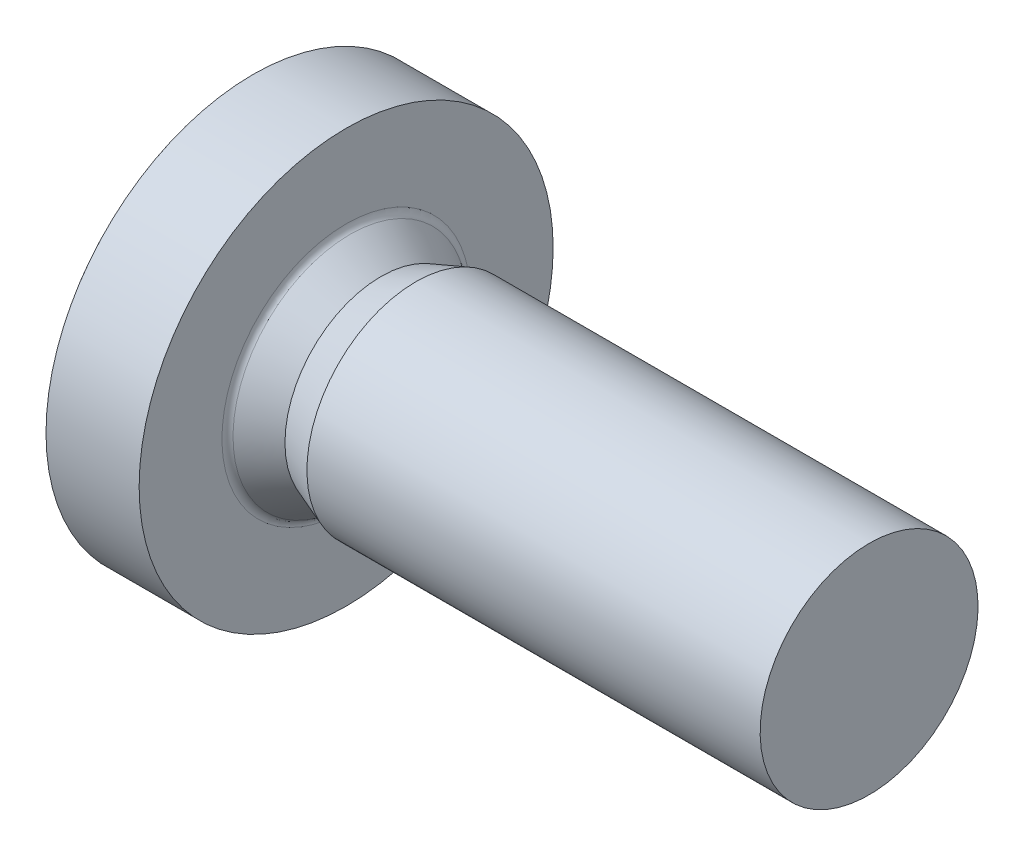
ISO-10303-21;
HEADER;
FILE_DESCRIPTION(('STEP AP214'),'2;1');
FILE_NAME('part.step','',(''),(''),'','','');
FILE_SCHEMA(('AUTOMOTIVE_DESIGN { 1 0 10303 214 1 1 1 1 }'));
ENDSEC;
DATA;
#1=APPLICATION_CONTEXT('core data for automotive mechanical design processes');
#2=APPLICATION_PROTOCOL_DEFINITION('international standard','automotive_design',2000,#1);
#3=PRODUCT_CONTEXT('',#1,'mechanical');
#4=PRODUCT('Part','Part','',(#3));
#5=PRODUCT_RELATED_PRODUCT_CATEGORY('part','',(#4));
#6=PRODUCT_DEFINITION_FORMATION('','',#4);
#7=PRODUCT_DEFINITION_CONTEXT('part definition',#1,'design');
#8=PRODUCT_DEFINITION('design','',#6,#7);
#9=PRODUCT_DEFINITION_SHAPE('','',#8);
#10=(LENGTH_UNIT() NAMED_UNIT(*) SI_UNIT(.MILLI.,.METRE.));
#11=(NAMED_UNIT(*) PLANE_ANGLE_UNIT() SI_UNIT($,.RADIAN.));
#12=(NAMED_UNIT(*) SI_UNIT($,.STERADIAN.) SOLID_ANGLE_UNIT());
#13=UNCERTAINTY_MEASURE_WITH_UNIT(LENGTH_MEASURE(1.E-05),#10,'distance_accuracy_value','');
#14=(GEOMETRIC_REPRESENTATION_CONTEXT(3) GLOBAL_UNCERTAINTY_ASSIGNED_CONTEXT((#13)) GLOBAL_UNIT_ASSIGNED_CONTEXT((#10,
#11,#12)) REPRESENTATION_CONTEXT('',''));
#15=CARTESIAN_POINT('',(0.,0.,0.));
#16=DIRECTION('',(0.,0.,1.));
#17=DIRECTION('',(1.,0.,0.));
#18=AXIS2_PLACEMENT_3D('',#15,#16,#17);
#19=CARTESIAN_POINT('',(12.,1.25,0.));
#20=DIRECTION('',(1.,0.,0.));
#21=DIRECTION('',(0.,1.,0.));
#22=AXIS2_PLACEMENT_3D('',#19,#20,#21);
#23=PLANE('',#22);
#24=CARTESIAN_POINT('',(12.,0.,0.));
#25=DIRECTION('',(1.,0.,0.));
#26=DIRECTION('',(0.,1.,0.));
#27=AXIS2_PLACEMENT_3D('',#24,#25,#26);
#28=CIRCLE('',#27,2.5);
#29=CARTESIAN_POINT('',(12.,2.5,0.));
#30=VERTEX_POINT('',#29);
#31=EDGE_CURVE('E9',#30,#30,#28,.T.);
#32=ORIENTED_EDGE('',*,*,#31,.T.);
#33=EDGE_LOOP('',(#32));
#34=FACE_BOUND('',#33,.T.);
#35=ADVANCED_FACE('F15',(#34),#23,.T.);
#36=CARTESIAN_POINT('',(6.8,0.,0.));
#37=DIRECTION('',(-1.,0.,0.));
#38=DIRECTION('',(0.,1.,0.));
#39=AXIS2_PLACEMENT_3D('',#36,#37,#38);
#40=CYLINDRICAL_SURFACE('',#39,2.5);
#41=CARTESIAN_POINT('',(1.6,0.,0.));
#42=DIRECTION('',(1.,0.,0.));
#43=DIRECTION('',(0.,1.,0.));
#44=AXIS2_PLACEMENT_3D('',#41,#42,#43);
#45=CIRCLE('',#44,2.5);
#46=CARTESIAN_POINT('',(1.6,2.5,0.));
#47=VERTEX_POINT('',#46);
#48=EDGE_CURVE('E25',#47,#47,#45,.T.);
#49=ORIENTED_EDGE('',*,*,#48,.T.);
#50=EDGE_LOOP('',(#49));
#51=FACE_BOUND('',#50,.T.);
#52=ORIENTED_EDGE('',*,*,#31,.F.);
#53=EDGE_LOOP('',(#52));
#54=FACE_BOUND('',#53,.T.);
#55=ADVANCED_FACE('F430',(#51,#54),#40,.T.);
#56=CARTESIAN_POINT('',(1.2,0.,0.));
#57=DIRECTION('',(1.,0.,0.));
#58=DIRECTION('',(0.,1.,0.));
#59=AXIS2_PLACEMENT_3D('',#56,#57,#58);
#60=CONICAL_SURFACE('',#59,2.352125,0.35410502091143);
#61=CARTESIAN_POINT('',(0.8,0.,0.));
#62=DIRECTION('',(1.,0.,0.));
#63=DIRECTION('',(0.,1.,0.));
#64=AXIS2_PLACEMENT_3D('',#61,#62,#63);
#65=CIRCLE('',#64,2.20425);
#66=CARTESIAN_POINT('',(0.8,2.20425,0.));
#67=VERTEX_POINT('',#66);
#68=EDGE_CURVE('E158',#67,#67,#65,.T.);
#69=ORIENTED_EDGE('',*,*,#68,.T.);
#70=EDGE_LOOP('',(#69));
#71=FACE_BOUND('',#70,.T.);
#72=ORIENTED_EDGE('',*,*,#48,.F.);
#73=EDGE_LOOP('',(#72));
#74=FACE_BOUND('',#73,.T.);
#75=ADVANCED_FACE('F435',(#71,#74),#60,.T.);
#76=CARTESIAN_POINT('',(0.444096618275084,0.,0.));
#77=DIRECTION('',(-1.,0.,0.));
#78=DIRECTION('',(0.,1.,0.));
#79=AXIS2_PLACEMENT_3D('',#76,#77,#78);
#80=CONICAL_SURFACE('',#79,2.44421051446388,0.593220065438029);
#81=CARTESIAN_POINT('',(0.0881932365501674,0.,0.));
#82=DIRECTION('',(1.,0.,0.));
#83=DIRECTION('',(0.,1.,0.));
#84=AXIS2_PLACEMENT_3D('',#81,#82,#83);
#85=CIRCLE('',#84,2.68417102892776);
#86=CARTESIAN_POINT('',(0.088193236550167,2.68417102892776,0.));
#87=VERTEX_POINT('',#86);
#88=EDGE_CURVE('E148',#87,#87,#85,.T.);
#89=ORIENTED_EDGE('',*,*,#88,.T.);
#90=EDGE_LOOP('',(#89));
#91=FACE_BOUND('',#90,.T.);
#92=ORIENTED_EDGE('',*,*,#68,.F.);
#93=EDGE_LOOP('',(#92));
#94=FACE_BOUND('',#93,.T.);
#95=ADVANCED_FACE('F491',(#91,#94),#80,.T.);
#96=CARTESIAN_POINT('',(0.2,0.,0.));
#97=DIRECTION('',(1.,0.,0.));
#98=DIRECTION('',(0.,0.,-1.));
#99=AXIS2_PLACEMENT_3D('',#96,#97,#98);
#100=TOROIDAL_SURFACE('',#99,2.85,0.2);
#101=CARTESIAN_POINT('',(0.,0.,0.));
#102=DIRECTION('',(1.,0.,0.));
#103=DIRECTION('',(0.,1.,0.));
#104=AXIS2_PLACEMENT_3D('',#101,#102,#103);
#105=CIRCLE('',#104,2.85);
#106=CARTESIAN_POINT('',(0.,2.85,0.));
#107=VERTEX_POINT('',#106);
#108=EDGE_CURVE('E152',#107,#107,#105,.T.);
#109=ORIENTED_EDGE('',*,*,#108,.T.);
#110=EDGE_LOOP('',(#109));
#111=FACE_BOUND('',#110,.T.);
#112=ORIENTED_EDGE('',*,*,#88,.F.);
#113=EDGE_LOOP('',(#112));
#114=FACE_BOUND('',#113,.T.);
#115=ADVANCED_FACE('F153',(#111,#114),#100,.F.);
#116=CARTESIAN_POINT('',(0.,3.8,0.));
#117=DIRECTION('',(1.,0.,0.));
#118=DIRECTION('',(0.,1.,0.));
#119=AXIS2_PLACEMENT_3D('',#116,#117,#118);
#120=PLANE('',#119);
#121=CARTESIAN_POINT('',(0.,0.,0.));
#122=DIRECTION('',(1.,0.,0.));
#123=DIRECTION('',(0.,1.,0.));
#124=AXIS2_PLACEMENT_3D('',#121,#122,#123);
#125=CIRCLE('',#124,4.75);
#126=CARTESIAN_POINT('',(0.,4.75,0.));
#127=VERTEX_POINT('',#126);
#128=EDGE_CURVE('E156',#127,#127,#125,.T.);
#129=ORIENTED_EDGE('',*,*,#128,.T.);
#130=EDGE_LOOP('',(#129));
#131=FACE_BOUND('',#130,.T.);
#132=ORIENTED_EDGE('',*,*,#108,.F.);
#133=EDGE_LOOP('',(#132));
#134=FACE_BOUND('',#133,.T.);
#135=ADVANCED_FACE('F464',(#131,#134),#120,.T.);
#136=CARTESIAN_POINT('',(-1.06859829739593,0.,0.));
#137=DIRECTION('',(-1.,0.,0.));
#138=DIRECTION('',(0.,1.,0.));
#139=AXIS2_PLACEMENT_3D('',#136,#137,#138);
#140=CYLINDRICAL_SURFACE('',#139,4.75);
#141=CARTESIAN_POINT('',(-2.13719659479187,0.,0.));
#142=DIRECTION('',(1.,0.,0.));
#143=DIRECTION('',(0.,1.,0.));
#144=AXIS2_PLACEMENT_3D('',#141,#142,#143);
#145=CIRCLE('',#144,4.75);
#146=CARTESIAN_POINT('',(-2.13719659479186,4.75,0.));
#147=VERTEX_POINT('',#146);
#148=EDGE_CURVE('E160',#147,#147,#145,.T.);
#149=ORIENTED_EDGE('',*,*,#148,.T.);
#150=EDGE_LOOP('',(#149));
#151=FACE_BOUND('',#150,.T.);
#152=ORIENTED_EDGE('',*,*,#128,.F.);
#153=EDGE_LOOP('',(#152));
#154=FACE_BOUND('',#153,.T.);
#155=ADVANCED_FACE('F17',(#151,#154),#140,.T.);
#156=CARTESIAN_POINT('',(4.3,0.,0.));
#157=DIRECTION('',(0.,0.,1.));
#158=DIRECTION('',(1.,0.,0.));
#159=AXIS2_PLACEMENT_3D('',#156,#157,#158);
#160=SPHERICAL_SURFACE('',#159,8.);
#161=ORIENTED_EDGE('',*,*,#148,.F.);
#162=EDGE_LOOP('',(#161));
#163=FACE_BOUND('',#162,.T.);
#164=CARTESIAN_POINT('',(4.3,2.45,0.));
#165=DIRECTION('',(0.,1.,0.));
#166=DIRECTION('',(0.,0.,-1.));
#167=AXIS2_PLACEMENT_3D('',#164,#165,#166);
#168=CIRCLE('',#167,7.61560897105412);
#169=CARTESIAN_POINT('',(-3.29982894544345,2.45,-0.49));
#170=VERTEX_POINT('',#169);
#171=CARTESIAN_POINT('',(-3.29982894544345,2.45,0.49));
#172=VERTEX_POINT('',#171);
#173=EDGE_CURVE('E310',#170,#172,#168,.T.);
#174=ORIENTED_EDGE('',*,*,#173,.T.);
#175=CARTESIAN_POINT('',(4.3,-0.0239333009683529,0.273558881846001));
#176=DIRECTION('',(0.,-0.0871557427476582,0.996194698091746));
#177=DIRECTION('',(0.,0.996194698091746,0.0871557427476582));
#178=AXIS2_PLACEMENT_3D('',#175,#176,#177);
#179=CIRCLE('',#178,7.99528565688981);
#180=CARTESIAN_POINT('',(-3.63151915239101,0.98,0.361391664616892));
#181=VERTEX_POINT('',#180);
#182=EDGE_CURVE('E204',#172,#181,#179,.T.);
#183=ORIENTED_EDGE('',*,*,#182,.T.);
#184=CARTESIAN_POINT('',(4.3,0.401487181137087,0.695396196317044));
#185=DIRECTION('',(0.,0.5,0.866025403784439));
#186=DIRECTION('',(0.,0.866025403784439,-0.5));
#187=AXIS2_PLACEMENT_3D('',#184,#185,#186);
#188=CIRCLE('',#187,7.95960000084994);
#189=CARTESIAN_POINT('',(-3.65669151886433,0.587818030359914,0.587818030359914));
#190=VERTEX_POINT('',#189);
#191=EDGE_CURVE('E196',#181,#190,#188,.T.);
#192=ORIENTED_EDGE('',*,*,#191,.T.);
#193=CARTESIAN_POINT('',(4.3,0.695396196317044,0.401487181137087));
#194=DIRECTION('',(0.,0.866025403784439,0.5));
#195=DIRECTION('',(0.,0.5,-0.866025403784439));
#196=AXIS2_PLACEMENT_3D('',#193,#194,#195);
#197=CIRCLE('',#196,7.95960000084994);
#198=CARTESIAN_POINT('',(-3.63151915239101,0.361391664616892,0.98));
#199=VERTEX_POINT('',#198);
#200=EDGE_CURVE('E190',#190,#199,#197,.T.);
#201=ORIENTED_EDGE('',*,*,#200,.T.);
#202=CARTESIAN_POINT('',(4.3,0.273558881846001,-0.0239333009683528));
#203=DIRECTION('',(0.,0.996194698091746,-0.0871557427476583));
#204=DIRECTION('',(0.,-0.0871557427476583,-0.996194698091746));
#205=AXIS2_PLACEMENT_3D('',#202,#203,#204);
#206=CIRCLE('',#205,7.99528565688981);
#207=CARTESIAN_POINT('',(-3.29982894544345,0.49,2.45));
#208=VERTEX_POINT('',#207);
#209=EDGE_CURVE('E189',#199,#208,#206,.T.);
#210=ORIENTED_EDGE('',*,*,#209,.T.);
#211=CARTESIAN_POINT('',(4.3,0.,2.45));
#212=DIRECTION('',(0.,0.,1.));
#213=DIRECTION('',(0.,1.,0.));
#214=AXIS2_PLACEMENT_3D('',#211,#212,#213);
#215=CIRCLE('',#214,7.61560897105412);
#216=CARTESIAN_POINT('',(-3.29982894544345,-0.49,2.45));
#217=VERTEX_POINT('',#216);
#218=EDGE_CURVE('E176',#208,#217,#215,.T.);
#219=ORIENTED_EDGE('',*,*,#218,.T.);
#220=CARTESIAN_POINT('',(4.3,-0.273558881846001,-0.0239333009683528));
#221=DIRECTION('',(0.,-0.996194698091746,-0.0871557427476581));
#222=DIRECTION('',(0.,-0.0871557427476581,0.996194698091746));
#223=AXIS2_PLACEMENT_3D('',#220,#221,#222);
#224=CIRCLE('',#223,7.99528565688981);
#225=CARTESIAN_POINT('',(-3.63151915239101,-0.361391664616892,0.98));
#226=VERTEX_POINT('',#225);
#227=EDGE_CURVE('E265',#217,#226,#224,.T.);
#228=ORIENTED_EDGE('',*,*,#227,.T.);
#229=CARTESIAN_POINT('',(4.3,-0.695396196317044,0.401487181137087));
#230=DIRECTION('',(0.,-0.866025403784439,0.5));
#231=DIRECTION('',(0.,0.5,0.866025403784439));
#232=AXIS2_PLACEMENT_3D('',#229,#230,#231);
#233=CIRCLE('',#232,7.95960000084994);
#234=CARTESIAN_POINT('',(-3.65669151886433,-0.587818030359914,0.587818030359914));
#235=VERTEX_POINT('',#234);
#236=EDGE_CURVE('E246',#226,#235,#233,.T.);
#237=ORIENTED_EDGE('',*,*,#236,.T.);
#238=CARTESIAN_POINT('',(4.3,-0.401487181137088,0.695396196317045));
#239=DIRECTION('',(0.,-0.5,0.866025403784439));
#240=DIRECTION('',(0.,0.866025403784439,0.5));
#241=AXIS2_PLACEMENT_3D('',#238,#239,#240);
#242=CIRCLE('',#241,7.95960000084994);
#243=CARTESIAN_POINT('',(-3.63151915239101,-0.98,0.361391664616892));
#244=VERTEX_POINT('',#243);
#245=EDGE_CURVE('E253',#235,#244,#242,.T.);
#246=ORIENTED_EDGE('',*,*,#245,.T.);
#247=CARTESIAN_POINT('',(4.3,0.0239333009683529,0.273558881846002));
#248=DIRECTION('',(0.,0.0871557427476582,0.996194698091746));
#249=DIRECTION('',(0.,0.996194698091746,-0.0871557427476582));
#250=AXIS2_PLACEMENT_3D('',#247,#248,#249);
#251=CIRCLE('',#250,7.99528565688981);
#252=CARTESIAN_POINT('',(-3.29982894544345,-2.45,0.49));
#253=VERTEX_POINT('',#252);
#254=EDGE_CURVE('E275',#244,#253,#251,.T.);
#255=ORIENTED_EDGE('',*,*,#254,.T.);
#256=CARTESIAN_POINT('',(4.3,-2.45,0.));
#257=DIRECTION('',(0.,-1.,0.));
#258=DIRECTION('',(0.,0.,1.));
#259=AXIS2_PLACEMENT_3D('',#256,#257,#258);
#260=CIRCLE('',#259,7.61560897105412);
#261=CARTESIAN_POINT('',(-3.29982894544345,-2.45,-0.49));
#262=VERTEX_POINT('',#261);
#263=EDGE_CURVE('E239',#253,#262,#260,.T.);
#264=ORIENTED_EDGE('',*,*,#263,.T.);
#265=CARTESIAN_POINT('',(4.3,0.0239333009683527,-0.273558881846001));
#266=DIRECTION('',(0.,0.087155742747658,-0.996194698091746));
#267=DIRECTION('',(0.,-0.996194698091746,-0.087155742747658));
#268=AXIS2_PLACEMENT_3D('',#265,#266,#267);
#269=CIRCLE('',#268,7.99528565688981);
#270=CARTESIAN_POINT('',(-3.63151915239101,-0.98,-0.361391664616892));
#271=VERTEX_POINT('',#270);
#272=EDGE_CURVE('E229',#262,#271,#269,.T.);
#273=ORIENTED_EDGE('',*,*,#272,.T.);
#274=CARTESIAN_POINT('',(4.3,-0.401487181137087,-0.695396196317044));
#275=DIRECTION('',(0.,-0.5,-0.866025403784439));
#276=DIRECTION('',(0.,-0.866025403784439,0.5));
#277=AXIS2_PLACEMENT_3D('',#274,#275,#276);
#278=CIRCLE('',#277,7.95960000084994);
#279=CARTESIAN_POINT('',(-3.65669151886433,-0.587818030359914,-0.587818030359913));
#280=VERTEX_POINT('',#279);
#281=EDGE_CURVE('E288',#271,#280,#278,.T.);
#282=ORIENTED_EDGE('',*,*,#281,.T.);
#283=CARTESIAN_POINT('',(4.3,-0.695396196317044,-0.401487181137087));
#284=DIRECTION('',(0.,-0.866025403784439,-0.5));
#285=DIRECTION('',(0.,-0.5,0.866025403784439));
#286=AXIS2_PLACEMENT_3D('',#283,#284,#285);
#287=CIRCLE('',#286,7.95960000084994);
#288=CARTESIAN_POINT('',(-3.63151915239101,-0.361391664616892,-0.98));
#289=VERTEX_POINT('',#288);
#290=EDGE_CURVE('E233',#280,#289,#287,.T.);
#291=ORIENTED_EDGE('',*,*,#290,.T.);
#292=CARTESIAN_POINT('',(4.3,-0.273558881846001,0.0239333009683528));
#293=DIRECTION('',(0.,-0.996194698091746,0.0871557427476582));
#294=DIRECTION('',(0.,0.0871557427476582,0.996194698091746));
#295=AXIS2_PLACEMENT_3D('',#292,#293,#294);
#296=CIRCLE('',#295,7.99528565688981);
#297=CARTESIAN_POINT('',(-3.29982894544345,-0.49,-2.45));
#298=VERTEX_POINT('',#297);
#299=EDGE_CURVE('E175',#289,#298,#296,.T.);
#300=ORIENTED_EDGE('',*,*,#299,.T.);
#301=CARTESIAN_POINT('',(4.3,0.,-2.45));
#302=DIRECTION('',(0.,0.,-1.));
#303=DIRECTION('',(0.,-1.,0.));
#304=AXIS2_PLACEMENT_3D('',#301,#302,#303);
#305=CIRCLE('',#304,7.61560897105412);
#306=CARTESIAN_POINT('',(-3.29982894544345,0.49,-2.45));
#307=VERTEX_POINT('',#306);
#308=EDGE_CURVE('E181',#298,#307,#305,.T.);
#309=ORIENTED_EDGE('',*,*,#308,.T.);
#310=CARTESIAN_POINT('',(4.3,0.273558881846001,0.0239333009683529));
#311=DIRECTION('',(0.,0.996194698091746,0.0871557427476582));
#312=DIRECTION('',(0.,0.0871557427476582,-0.996194698091746));
#313=AXIS2_PLACEMENT_3D('',#310,#311,#312);
#314=CIRCLE('',#313,7.99528565688981);
#315=CARTESIAN_POINT('',(-3.63151915239101,0.361391664616892,-0.98));
#316=VERTEX_POINT('',#315);
#317=EDGE_CURVE('E185',#307,#316,#314,.T.);
#318=ORIENTED_EDGE('',*,*,#317,.T.);
#319=CARTESIAN_POINT('',(4.3,0.695396196317044,-0.401487181137087));
#320=DIRECTION('',(0.,0.866025403784439,-0.5));
#321=DIRECTION('',(0.,-0.5,-0.866025403784439));
#322=AXIS2_PLACEMENT_3D('',#319,#320,#321);
#323=CIRCLE('',#322,7.95960000084994);
#324=CARTESIAN_POINT('',(-3.65669151886433,0.587818030359913,-0.587818030359914));
#325=VERTEX_POINT('',#324);
#326=EDGE_CURVE('E215',#316,#325,#323,.T.);
#327=ORIENTED_EDGE('',*,*,#326,.T.);
#328=CARTESIAN_POINT('',(4.3,0.401487181137088,-0.695396196317044));
#329=DIRECTION('',(0.,0.5,-0.866025403784438));
#330=DIRECTION('',(0.,-0.866025403784438,-0.5));
#331=AXIS2_PLACEMENT_3D('',#328,#329,#330);
#332=CIRCLE('',#331,7.95960000084994);
#333=CARTESIAN_POINT('',(-3.63151915239101,0.98,-0.361391664616892));
#334=VERTEX_POINT('',#333);
#335=EDGE_CURVE('E270',#325,#334,#332,.T.);
#336=ORIENTED_EDGE('',*,*,#335,.T.);
#337=CARTESIAN_POINT('',(4.3,-0.0239333009683528,-0.273558881846));
#338=DIRECTION('',(0.,-0.0871557427476583,-0.996194698091746));
#339=DIRECTION('',(0.,-0.996194698091746,0.0871557427476583));
#340=AXIS2_PLACEMENT_3D('',#337,#338,#339);
#341=CIRCLE('',#340,7.99528565688981);
#342=EDGE_CURVE('E166',#334,#170,#341,.T.);
#343=ORIENTED_EDGE('',*,*,#342,.T.);
#344=EDGE_LOOP('',(#174,#183,#192,#201,#210,#219,#228,#237,#246,#255,#264,#273,#282,#291,#300,
#309,#318,#327,#336,#343));
#345=FACE_BOUND('',#344,.T.);
#346=ADVANCED_FACE('F327',(#163,#345),#160,.T.);
#347=CARTESIAN_POINT('',(-1.85,0.,0.));
#348=DIRECTION('',(1.,0.,0.));
#349=DIRECTION('',(0.,0.,-1.));
#350=AXIS2_PLACEMENT_3D('',#347,#348,#349);
#351=PLANE('',#350);
#352=DIRECTION('',(0.,0.,-1.));
#353=VECTOR('',#352,1.);
#354=CARTESIAN_POINT('',(-1.85,2.45,-0.49));
#355=LINE('',#354,#353);
#356=CARTESIAN_POINT('',(-1.85,2.45,0.49));
#357=VERTEX_POINT('',#356);
#358=CARTESIAN_POINT('',(-1.85,2.45,-0.49));
#359=VERTEX_POINT('',#358);
#360=EDGE_CURVE('E307',#357,#359,#355,.T.);
#361=ORIENTED_EDGE('',*,*,#360,.T.);
#362=DIRECTION('',(0.,-0.996194698091746,0.0871557427476583));
#363=VECTOR('',#362,1.);
#364=CARTESIAN_POINT('',(-1.85,2.45,-0.49));
#365=LINE('',#364,#363);
#366=CARTESIAN_POINT('',(-1.85,0.98,-0.361391664616892));
#367=VERTEX_POINT('',#366);
#368=EDGE_CURVE('E169',#359,#367,#365,.T.);
#369=ORIENTED_EDGE('',*,*,#368,.T.);
#370=DIRECTION('',(0.,-0.866025403784438,-0.5));
#371=VECTOR('',#370,1.);
#372=CARTESIAN_POINT('',(-1.85,0.98,-0.361391664616892));
#373=LINE('',#372,#371);
#374=CARTESIAN_POINT('',(-1.85,0.587818030359913,-0.587818030359914));
#375=VERTEX_POINT('',#374);
#376=EDGE_CURVE('E305',#367,#375,#373,.T.);
#377=ORIENTED_EDGE('',*,*,#376,.T.);
#378=DIRECTION('',(0.,-0.5,-0.866025403784439));
#379=VECTOR('',#378,1.);
#380=CARTESIAN_POINT('',(-1.85,0.361391664616892,-0.98));
#381=LINE('',#380,#379);
#382=CARTESIAN_POINT('',(-1.85,0.361391664616892,-0.98));
#383=VERTEX_POINT('',#382);
#384=EDGE_CURVE('E217',#375,#383,#381,.T.);
#385=ORIENTED_EDGE('',*,*,#384,.T.);
#386=DIRECTION('',(0.,0.0871557427476582,-0.996194698091746));
#387=VECTOR('',#386,1.);
#388=CARTESIAN_POINT('',(-1.85,0.49,-2.45));
#389=LINE('',#388,#387);
#390=CARTESIAN_POINT('',(-1.85,0.49,-2.45));
#391=VERTEX_POINT('',#390);
#392=EDGE_CURVE('E182',#383,#391,#389,.T.);
#393=ORIENTED_EDGE('',*,*,#392,.T.);
#394=DIRECTION('',(0.,-1.,0.));
#395=VECTOR('',#394,1.);
#396=CARTESIAN_POINT('',(-1.85,-0.49,-2.45));
#397=LINE('',#396,#395);
#398=CARTESIAN_POINT('',(-1.85,-0.49,-2.45));
#399=VERTEX_POINT('',#398);
#400=EDGE_CURVE('E251',#391,#399,#397,.T.);
#401=ORIENTED_EDGE('',*,*,#400,.T.);
#402=DIRECTION('',(0.,0.0871557427476582,0.996194698091746));
#403=VECTOR('',#402,1.);
#404=CARTESIAN_POINT('',(-1.85,-0.49,-2.45));
#405=LINE('',#404,#403);
#406=CARTESIAN_POINT('',(-1.85,-0.361391664616892,-0.98));
#407=VERTEX_POINT('',#406);
#408=EDGE_CURVE('E171',#399,#407,#405,.T.);
#409=ORIENTED_EDGE('',*,*,#408,.T.);
#410=DIRECTION('',(0.,-0.5,0.866025403784439));
#411=VECTOR('',#410,1.);
#412=CARTESIAN_POINT('',(-1.85,-0.361391664616892,-0.98));
#413=LINE('',#412,#411);
#414=CARTESIAN_POINT('',(-1.85,-0.587818030359914,-0.587818030359913));
#415=VERTEX_POINT('',#414);
#416=EDGE_CURVE('E274',#407,#415,#413,.T.);
#417=ORIENTED_EDGE('',*,*,#416,.T.);
#418=DIRECTION('',(0.,-0.866025403784439,0.5));
#419=VECTOR('',#418,1.);
#420=CARTESIAN_POINT('',(-1.85,-0.98,-0.361391664616892));
#421=LINE('',#420,#419);
#422=CARTESIAN_POINT('',(-1.85,-0.98,-0.361391664616892));
#423=VERTEX_POINT('',#422);
#424=EDGE_CURVE('E234',#415,#423,#421,.T.);
#425=ORIENTED_EDGE('',*,*,#424,.T.);
#426=DIRECTION('',(0.,-0.996194698091746,-0.087155742747658));
#427=VECTOR('',#426,1.);
#428=CARTESIAN_POINT('',(-1.85,-2.45,-0.49));
#429=LINE('',#428,#427);
#430=CARTESIAN_POINT('',(-1.85,-2.45,-0.49));
#431=VERTEX_POINT('',#430);
#432=EDGE_CURVE('E226',#423,#431,#429,.T.);
#433=ORIENTED_EDGE('',*,*,#432,.T.);
#434=DIRECTION('',(0.,0.,1.));
#435=VECTOR('',#434,1.);
#436=CARTESIAN_POINT('',(-1.85,-2.45,0.49));
#437=LINE('',#436,#435);
#438=CARTESIAN_POINT('',(-1.85,-2.45,0.49));
#439=VERTEX_POINT('',#438);
#440=EDGE_CURVE('E238',#431,#439,#437,.T.);
#441=ORIENTED_EDGE('',*,*,#440,.T.);
#442=DIRECTION('',(0.,0.996194698091746,-0.0871557427476581));
#443=VECTOR('',#442,1.);
#444=CARTESIAN_POINT('',(-1.85,-2.45,0.49));
#445=LINE('',#444,#443);
#446=CARTESIAN_POINT('',(-1.85,-0.98,0.361391664616892));
#447=VERTEX_POINT('',#446);
#448=EDGE_CURVE('E257',#439,#447,#445,.T.);
#449=ORIENTED_EDGE('',*,*,#448,.T.);
#450=DIRECTION('',(0.,0.866025403784439,0.5));
#451=VECTOR('',#450,1.);
#452=CARTESIAN_POINT('',(-1.85,-0.98,0.361391664616892));
#453=LINE('',#452,#451);
#454=CARTESIAN_POINT('',(-1.85,-0.587818030359914,0.587818030359914));
#455=VERTEX_POINT('',#454);
#456=EDGE_CURVE('E243',#447,#455,#453,.T.);
#457=ORIENTED_EDGE('',*,*,#456,.T.);
#458=DIRECTION('',(0.,0.5,0.866025403784439));
#459=VECTOR('',#458,1.);
#460=CARTESIAN_POINT('',(-1.85,-0.361391664616892,0.98));
#461=LINE('',#460,#459);
#462=CARTESIAN_POINT('',(-1.85,-0.361391664616892,0.98));
#463=VERTEX_POINT('',#462);
#464=EDGE_CURVE('E164',#455,#463,#461,.T.);
#465=ORIENTED_EDGE('',*,*,#464,.T.);
#466=DIRECTION('',(0.,-0.0871557427476581,0.996194698091746));
#467=VECTOR('',#466,1.);
#468=CARTESIAN_POINT('',(-1.85,-0.49,2.45));
#469=LINE('',#468,#467);
#470=CARTESIAN_POINT('',(-1.85,-0.49,2.45));
#471=VERTEX_POINT('',#470);
#472=EDGE_CURVE('E19',#463,#471,#469,.T.);
#473=ORIENTED_EDGE('',*,*,#472,.T.);
#474=DIRECTION('',(0.,1.,0.));
#475=VECTOR('',#474,1.);
#476=CARTESIAN_POINT('',(-1.85,0.49,2.45));
#477=LINE('',#476,#475);
#478=CARTESIAN_POINT('',(-1.85,0.49,2.45));
#479=VERTEX_POINT('',#478);
#480=EDGE_CURVE('E186',#471,#479,#477,.T.);
#481=ORIENTED_EDGE('',*,*,#480,.T.);
#482=DIRECTION('',(0.,-0.0871557427476583,-0.996194698091746));
#483=VECTOR('',#482,1.);
#484=CARTESIAN_POINT('',(-1.85,0.49,2.45));
#485=LINE('',#484,#483);
#486=CARTESIAN_POINT('',(-1.85,0.361391664616892,0.98));
#487=VERTEX_POINT('',#486);
#488=EDGE_CURVE('E193',#479,#487,#485,.T.);
#489=ORIENTED_EDGE('',*,*,#488,.T.);
#490=DIRECTION('',(0.,0.5,-0.866025403784439));
#491=VECTOR('',#490,1.);
#492=CARTESIAN_POINT('',(-1.85,0.361391664616892,0.98));
#493=LINE('',#492,#491);
#494=CARTESIAN_POINT('',(-1.85,0.587818030359914,0.587818030359914));
#495=VERTEX_POINT('',#494);
#496=EDGE_CURVE('E194',#487,#495,#493,.T.);
#497=ORIENTED_EDGE('',*,*,#496,.T.);
#498=DIRECTION('',(0.,0.866025403784439,-0.5));
#499=VECTOR('',#498,1.);
#500=CARTESIAN_POINT('',(-1.85,0.98,0.361391664616892));
#501=LINE('',#500,#499);
#502=CARTESIAN_POINT('',(-1.85,0.98,0.361391664616892));
#503=VERTEX_POINT('',#502);
#504=EDGE_CURVE('E199',#495,#503,#501,.T.);
#505=ORIENTED_EDGE('',*,*,#504,.T.);
#506=DIRECTION('',(0.,0.996194698091746,0.0871557427476582));
#507=VECTOR('',#506,1.);
#508=CARTESIAN_POINT('',(-1.85,2.45,0.49));
#509=LINE('',#508,#507);
#510=EDGE_CURVE('E220',#503,#357,#509,.T.);
#511=ORIENTED_EDGE('',*,*,#510,.T.);
#512=EDGE_LOOP('',(#361,#369,#377,#385,#393,#401,#409,#417,#425,#433,#441,#449,#457,#465,#473,
#481,#489,#497,#505,#511));
#513=FACE_BOUND('',#512,.T.);
#514=ADVANCED_FACE('F342',(#513),#351,.F.);
#515=CARTESIAN_POINT('',(-4.07,1.715,0.425695832308446));
#516=DIRECTION('',(0.,-0.0871557427476582,0.996194698091746));
#517=DIRECTION('',(0.,-0.996194698091746,-0.0871557427476582));
#518=AXIS2_PLACEMENT_3D('',#515,#516,#517);
#519=PLANE('',#518);
#520=ORIENTED_EDGE('',*,*,#182,.F.);
#521=DIRECTION('',(1.,0.,0.));
#522=VECTOR('',#521,1.);
#523=CARTESIAN_POINT('',(-4.07,2.45,0.49));
#524=LINE('',#523,#522);
#525=EDGE_CURVE('E277',#172,#357,#524,.T.);
#526=ORIENTED_EDGE('',*,*,#525,.T.);
#527=ORIENTED_EDGE('',*,*,#510,.F.);
#528=DIRECTION('',(1.,0.,0.));
#529=VECTOR('',#528,1.);
#530=CARTESIAN_POINT('',(-4.07,0.98,0.361391664616892));
#531=LINE('',#530,#529);
#532=EDGE_CURVE('E197',#181,#503,#531,.T.);
#533=ORIENTED_EDGE('',*,*,#532,.F.);
#534=EDGE_LOOP('',(#520,#526,#527,#533));
#535=FACE_BOUND('',#534,.T.);
#536=ADVANCED_FACE('F453',(#535),#519,.F.);
#537=CARTESIAN_POINT('',(-4.07,0.783909015179957,0.474604847488403));
#538=DIRECTION('',(0.,0.5,0.866025403784439));
#539=DIRECTION('',(0.,-0.866025403784439,0.5));
#540=AXIS2_PLACEMENT_3D('',#537,#538,#539);
#541=PLANE('',#540);
#542=ORIENTED_EDGE('',*,*,#191,.F.);
#543=ORIENTED_EDGE('',*,*,#532,.T.);
#544=ORIENTED_EDGE('',*,*,#504,.F.);
#545=DIRECTION('',(1.,0.,0.));
#546=VECTOR('',#545,1.);
#547=CARTESIAN_POINT('',(-4.07,0.587818030359914,0.587818030359913));
#548=LINE('',#547,#546);
#549=EDGE_CURVE('E192',#190,#495,#548,.T.);
#550=ORIENTED_EDGE('',*,*,#549,.F.);
#551=EDGE_LOOP('',(#542,#543,#544,#550));
#552=FACE_BOUND('',#551,.T.);
#553=ADVANCED_FACE('F449',(#552),#541,.F.);
#554=CARTESIAN_POINT('',(-4.07,0.474604847488403,0.783909015179957));
#555=DIRECTION('',(0.,0.866025403784439,0.5));
#556=DIRECTION('',(0.,-0.5,0.866025403784439));
#557=AXIS2_PLACEMENT_3D('',#554,#555,#556);
#558=PLANE('',#557);
#559=ORIENTED_EDGE('',*,*,#200,.F.);
#560=ORIENTED_EDGE('',*,*,#549,.T.);
#561=ORIENTED_EDGE('',*,*,#496,.F.);
#562=DIRECTION('',(1.,0.,0.));
#563=VECTOR('',#562,1.);
#564=CARTESIAN_POINT('',(-4.07,0.361391664616892,0.98));
#565=LINE('',#564,#563);
#566=EDGE_CURVE('E225',#199,#487,#565,.T.);
#567=ORIENTED_EDGE('',*,*,#566,.F.);
#568=EDGE_LOOP('',(#559,#560,#561,#567));
#569=FACE_BOUND('',#568,.T.);
#570=ADVANCED_FACE('F452',(#569),#558,.F.);
#571=CARTESIAN_POINT('',(-4.07,0.425695832308446,1.715));
#572=DIRECTION('',(0.,0.996194698091746,-0.0871557427476583));
#573=DIRECTION('',(0.,0.0871557427476583,0.996194698091746));
#574=AXIS2_PLACEMENT_3D('',#571,#572,#573);
#575=PLANE('',#574);
#576=ORIENTED_EDGE('',*,*,#209,.F.);
#577=ORIENTED_EDGE('',*,*,#566,.T.);
#578=ORIENTED_EDGE('',*,*,#488,.F.);
#579=DIRECTION('',(1.,0.,0.));
#580=VECTOR('',#579,1.);
#581=CARTESIAN_POINT('',(-4.07,0.49,2.45));
#582=LINE('',#581,#580);
#583=EDGE_CURVE('E178',#208,#479,#582,.T.);
#584=ORIENTED_EDGE('',*,*,#583,.F.);
#585=EDGE_LOOP('',(#576,#577,#578,#584));
#586=FACE_BOUND('',#585,.T.);
#587=ADVANCED_FACE('F363',(#586),#575,.F.);
#588=CARTESIAN_POINT('',(-4.07,0.,2.45));
#589=DIRECTION('',(0.,0.,1.));
#590=DIRECTION('',(0.,-1.,0.));
#591=AXIS2_PLACEMENT_3D('',#588,#589,#590);
#592=PLANE('',#591);
#593=ORIENTED_EDGE('',*,*,#218,.F.);
#594=ORIENTED_EDGE('',*,*,#583,.T.);
#595=ORIENTED_EDGE('',*,*,#480,.F.);
#596=DIRECTION('',(1.,0.,0.));
#597=VECTOR('',#596,1.);
#598=CARTESIAN_POINT('',(-4.07,-0.49,2.45));
#599=LINE('',#598,#597);
#600=EDGE_CURVE('E280',#217,#471,#599,.T.);
#601=ORIENTED_EDGE('',*,*,#600,.F.);
#602=EDGE_LOOP('',(#593,#594,#595,#601));
#603=FACE_BOUND('',#602,.T.);
#604=ADVANCED_FACE('F350',(#603),#592,.F.);
#605=CARTESIAN_POINT('',(-4.07,-0.425695832308446,1.715));
#606=DIRECTION('',(0.,-0.996194698091746,-0.0871557427476581));
#607=DIRECTION('',(0.,0.0871557427476581,-0.996194698091746));
#608=AXIS2_PLACEMENT_3D('',#605,#606,#607);
#609=PLANE('',#608);
#610=ORIENTED_EDGE('',*,*,#227,.F.);
#611=ORIENTED_EDGE('',*,*,#600,.T.);
#612=ORIENTED_EDGE('',*,*,#472,.F.);
#613=DIRECTION('',(1.,0.,0.));
#614=VECTOR('',#613,1.);
#615=CARTESIAN_POINT('',(-4.07,-0.361391664616892,0.98));
#616=LINE('',#615,#614);
#617=EDGE_CURVE('E279',#226,#463,#616,.T.);
#618=ORIENTED_EDGE('',*,*,#617,.F.);
#619=EDGE_LOOP('',(#610,#611,#612,#618));
#620=FACE_BOUND('',#619,.T.);
#621=ADVANCED_FACE('F356',(#620),#609,.F.);
#622=CARTESIAN_POINT('',(-4.07,-0.474604847488403,0.783909015179957));
#623=DIRECTION('',(0.,-0.866025403784439,0.5));
#624=DIRECTION('',(0.,-0.5,-0.866025403784439));
#625=AXIS2_PLACEMENT_3D('',#622,#623,#624);
#626=PLANE('',#625);
#627=ORIENTED_EDGE('',*,*,#236,.F.);
#628=ORIENTED_EDGE('',*,*,#617,.T.);
#629=ORIENTED_EDGE('',*,*,#464,.F.);
#630=DIRECTION('',(1.,0.,0.));
#631=VECTOR('',#630,1.);
#632=CARTESIAN_POINT('',(-4.07,-0.587818030359914,0.587818030359914));
#633=LINE('',#632,#631);
#634=EDGE_CURVE('E247',#235,#455,#633,.T.);
#635=ORIENTED_EDGE('',*,*,#634,.F.);
#636=EDGE_LOOP('',(#627,#628,#629,#635));
#637=FACE_BOUND('',#636,.T.);
#638=ADVANCED_FACE('F417',(#637),#626,.F.);
#639=CARTESIAN_POINT('',(-4.07,-0.783909015179957,0.474604847488403));
#640=DIRECTION('',(0.,-0.5,0.866025403784439));
#641=DIRECTION('',(0.,-0.866025403784439,-0.5));
#642=AXIS2_PLACEMENT_3D('',#639,#640,#641);
#643=PLANE('',#642);
#644=ORIENTED_EDGE('',*,*,#245,.F.);
#645=ORIENTED_EDGE('',*,*,#634,.T.);
#646=ORIENTED_EDGE('',*,*,#456,.F.);
#647=DIRECTION('',(1.,0.,0.));
#648=VECTOR('',#647,1.);
#649=CARTESIAN_POINT('',(-4.07,-0.98,0.361391664616892));
#650=LINE('',#649,#648);
#651=EDGE_CURVE('E261',#244,#447,#650,.T.);
#652=ORIENTED_EDGE('',*,*,#651,.F.);
#653=EDGE_LOOP('',(#644,#645,#646,#652));
#654=FACE_BOUND('',#653,.T.);
#655=ADVANCED_FACE('F415',(#654),#643,.F.);
#656=CARTESIAN_POINT('',(-4.07,-1.715,0.425695832308446));
#657=DIRECTION('',(0.,0.0871557427476582,0.996194698091746));
#658=DIRECTION('',(0.,-0.996194698091746,0.0871557427476582));
#659=AXIS2_PLACEMENT_3D('',#656,#657,#658);
#660=PLANE('',#659);
#661=ORIENTED_EDGE('',*,*,#254,.F.);
#662=ORIENTED_EDGE('',*,*,#651,.T.);
#663=ORIENTED_EDGE('',*,*,#448,.F.);
#664=DIRECTION('',(1.,0.,0.));
#665=VECTOR('',#664,1.);
#666=CARTESIAN_POINT('',(-4.07,-2.45,0.49));
#667=LINE('',#666,#665);
#668=EDGE_CURVE('E235',#253,#439,#667,.T.);
#669=ORIENTED_EDGE('',*,*,#668,.F.);
#670=EDGE_LOOP('',(#661,#662,#663,#669));
#671=FACE_BOUND('',#670,.T.);
#672=ADVANCED_FACE('F414',(#671),#660,.F.);
#673=CARTESIAN_POINT('',(-4.07,2.45,0.));
#674=DIRECTION('',(0.,1.,0.));
#675=DIRECTION('',(0.,0.,1.));
#676=AXIS2_PLACEMENT_3D('',#673,#674,#675);
#677=PLANE('',#676);
#678=ORIENTED_EDGE('',*,*,#173,.F.);
#679=DIRECTION('',(1.,0.,0.));
#680=VECTOR('',#679,1.);
#681=CARTESIAN_POINT('',(-4.07,2.45,-0.49));
#682=LINE('',#681,#680);
#683=EDGE_CURVE('E312',#170,#359,#682,.T.);
#684=ORIENTED_EDGE('',*,*,#683,.T.);
#685=ORIENTED_EDGE('',*,*,#360,.F.);
#686=ORIENTED_EDGE('',*,*,#525,.F.);
#687=EDGE_LOOP('',(#678,#684,#685,#686));
#688=FACE_BOUND('',#687,.T.);
#689=ADVANCED_FACE('F332',(#688),#677,.F.);
#690=CARTESIAN_POINT('',(-4.07,1.715,-0.425695832308446));
#691=DIRECTION('',(0.,-0.0871557427476583,-0.996194698091746));
#692=DIRECTION('',(0.,0.996194698091746,-0.0871557427476583));
#693=AXIS2_PLACEMENT_3D('',#690,#691,#692);
#694=PLANE('',#693);
#695=ORIENTED_EDGE('',*,*,#342,.F.);
#696=DIRECTION('',(1.,0.,0.));
#697=VECTOR('',#696,1.);
#698=CARTESIAN_POINT('',(-4.07,0.98,-0.361391664616892));
#699=LINE('',#698,#697);
#700=EDGE_CURVE('E170',#334,#367,#699,.T.);
#701=ORIENTED_EDGE('',*,*,#700,.T.);
#702=ORIENTED_EDGE('',*,*,#368,.F.);
#703=ORIENTED_EDGE('',*,*,#683,.F.);
#704=EDGE_LOOP('',(#695,#701,#702,#703));
#705=FACE_BOUND('',#704,.T.);
#706=ADVANCED_FACE('F337',(#705),#694,.F.);
#707=CARTESIAN_POINT('',(-4.07,0.783909015179957,-0.474604847488403));
#708=DIRECTION('',(0.,0.5,-0.866025403784438));
#709=DIRECTION('',(0.,0.866025403784438,0.5));
#710=AXIS2_PLACEMENT_3D('',#707,#708,#709);
#711=PLANE('',#710);
#712=ORIENTED_EDGE('',*,*,#335,.F.);
#713=DIRECTION('',(1.,0.,0.));
#714=VECTOR('',#713,1.);
#715=CARTESIAN_POINT('',(-4.07,0.587818030359913,-0.587818030359914));
#716=LINE('',#715,#714);
#717=EDGE_CURVE('E267',#325,#375,#716,.T.);
#718=ORIENTED_EDGE('',*,*,#717,.T.);
#719=ORIENTED_EDGE('',*,*,#376,.F.);
#720=ORIENTED_EDGE('',*,*,#700,.F.);
#721=EDGE_LOOP('',(#712,#718,#719,#720));
#722=FACE_BOUND('',#721,.T.);
#723=ADVANCED_FACE('F443',(#722),#711,.F.);
#724=CARTESIAN_POINT('',(-4.07,0.474604847488403,-0.783909015179957));
#725=DIRECTION('',(0.,0.866025403784439,-0.5));
#726=DIRECTION('',(0.,0.5,0.866025403784439));
#727=AXIS2_PLACEMENT_3D('',#724,#725,#726);
#728=PLANE('',#727);
#729=ORIENTED_EDGE('',*,*,#326,.F.);
#730=DIRECTION('',(1.,0.,0.));
#731=VECTOR('',#730,1.);
#732=CARTESIAN_POINT('',(-4.07,0.361391664616892,-0.98));
#733=LINE('',#732,#731);
#734=EDGE_CURVE('E184',#316,#383,#733,.T.);
#735=ORIENTED_EDGE('',*,*,#734,.T.);
#736=ORIENTED_EDGE('',*,*,#384,.F.);
#737=ORIENTED_EDGE('',*,*,#717,.F.);
#738=EDGE_LOOP('',(#729,#735,#736,#737));
#739=FACE_BOUND('',#738,.T.);
#740=ADVANCED_FACE('F377',(#739),#728,.F.);
#741=CARTESIAN_POINT('',(-4.07,0.425695832308446,-1.715));
#742=DIRECTION('',(0.,0.996194698091746,0.0871557427476582));
#743=DIRECTION('',(0.,-0.0871557427476582,0.996194698091746));
#744=AXIS2_PLACEMENT_3D('',#741,#742,#743);
#745=PLANE('',#744);
#746=ORIENTED_EDGE('',*,*,#317,.F.);
#747=DIRECTION('',(1.,0.,0.));
#748=VECTOR('',#747,1.);
#749=CARTESIAN_POINT('',(-4.07,0.49,-2.45));
#750=LINE('',#749,#748);
#751=EDGE_CURVE('E242',#307,#391,#750,.T.);
#752=ORIENTED_EDGE('',*,*,#751,.T.);
#753=ORIENTED_EDGE('',*,*,#392,.F.);
#754=ORIENTED_EDGE('',*,*,#734,.F.);
#755=EDGE_LOOP('',(#746,#752,#753,#754));
#756=FACE_BOUND('',#755,.T.);
#757=ADVANCED_FACE('F379',(#756),#745,.F.);
#758=CARTESIAN_POINT('',(-4.07,0.,-2.45));
#759=DIRECTION('',(0.,0.,-1.));
#760=DIRECTION('',(0.,1.,0.));
#761=AXIS2_PLACEMENT_3D('',#758,#759,#760);
#762=PLANE('',#761);
#763=ORIENTED_EDGE('',*,*,#308,.F.);
#764=DIRECTION('',(1.,0.,0.));
#765=VECTOR('',#764,1.);
#766=CARTESIAN_POINT('',(-4.07,-0.49,-2.45));
#767=LINE('',#766,#765);
#768=EDGE_CURVE('E174',#298,#399,#767,.T.);
#769=ORIENTED_EDGE('',*,*,#768,.T.);
#770=ORIENTED_EDGE('',*,*,#400,.F.);
#771=ORIENTED_EDGE('',*,*,#751,.F.);
#772=EDGE_LOOP('',(#763,#769,#770,#771));
#773=FACE_BOUND('',#772,.T.);
#774=ADVANCED_FACE('F383',(#773),#762,.F.);
#775=CARTESIAN_POINT('',(-4.07,-0.425695832308446,-1.715));
#776=DIRECTION('',(0.,-0.996194698091746,0.0871557427476582));
#777=DIRECTION('',(0.,-0.0871557427476582,-0.996194698091746));
#778=AXIS2_PLACEMENT_3D('',#775,#776,#777);
#779=PLANE('',#778);
#780=ORIENTED_EDGE('',*,*,#299,.F.);
#781=DIRECTION('',(1.,0.,0.));
#782=VECTOR('',#781,1.);
#783=CARTESIAN_POINT('',(-4.07,-0.361391664616892,-0.98));
#784=LINE('',#783,#782);
#785=EDGE_CURVE('E271',#289,#407,#784,.T.);
#786=ORIENTED_EDGE('',*,*,#785,.T.);
#787=ORIENTED_EDGE('',*,*,#408,.F.);
#788=ORIENTED_EDGE('',*,*,#768,.F.);
#789=EDGE_LOOP('',(#780,#786,#787,#788));
#790=FACE_BOUND('',#789,.T.);
#791=ADVANCED_FACE('F390',(#790),#779,.F.);
#792=CARTESIAN_POINT('',(-4.07,-0.474604847488403,-0.783909015179957));
#793=DIRECTION('',(0.,-0.866025403784439,-0.5));
#794=DIRECTION('',(0.,0.5,-0.866025403784439));
#795=AXIS2_PLACEMENT_3D('',#792,#793,#794);
#796=PLANE('',#795);
#797=ORIENTED_EDGE('',*,*,#290,.F.);
#798=DIRECTION('',(1.,0.,0.));
#799=VECTOR('',#798,1.);
#800=CARTESIAN_POINT('',(-4.07,-0.587818030359914,-0.587818030359914));
#801=LINE('',#800,#799);
#802=EDGE_CURVE('E230',#280,#415,#801,.T.);
#803=ORIENTED_EDGE('',*,*,#802,.T.);
#804=ORIENTED_EDGE('',*,*,#416,.F.);
#805=ORIENTED_EDGE('',*,*,#785,.F.);
#806=EDGE_LOOP('',(#797,#803,#804,#805));
#807=FACE_BOUND('',#806,.T.);
#808=ADVANCED_FACE('F393',(#807),#796,.F.);
#809=CARTESIAN_POINT('',(-4.07,-0.783909015179957,-0.474604847488403));
#810=DIRECTION('',(0.,-0.5,-0.866025403784439));
#811=DIRECTION('',(0.,0.866025403784439,-0.5));
#812=AXIS2_PLACEMENT_3D('',#809,#810,#811);
#813=PLANE('',#812);
#814=ORIENTED_EDGE('',*,*,#281,.F.);
#815=DIRECTION('',(1.,0.,0.));
#816=VECTOR('',#815,1.);
#817=CARTESIAN_POINT('',(-4.07,-0.98,-0.361391664616892));
#818=LINE('',#817,#816);
#819=EDGE_CURVE('E228',#271,#423,#818,.T.);
#820=ORIENTED_EDGE('',*,*,#819,.T.);
#821=ORIENTED_EDGE('',*,*,#424,.F.);
#822=ORIENTED_EDGE('',*,*,#802,.F.);
#823=EDGE_LOOP('',(#814,#820,#821,#822));
#824=FACE_BOUND('',#823,.T.);
#825=ADVANCED_FACE('F397',(#824),#813,.F.);
#826=CARTESIAN_POINT('',(-4.07,-1.715,-0.425695832308446));
#827=DIRECTION('',(0.,0.087155742747658,-0.996194698091746));
#828=DIRECTION('',(0.,0.996194698091746,0.087155742747658));
#829=AXIS2_PLACEMENT_3D('',#826,#827,#828);
#830=PLANE('',#829);
#831=ORIENTED_EDGE('',*,*,#272,.F.);
#832=DIRECTION('',(1.,0.,0.));
#833=VECTOR('',#832,1.);
#834=CARTESIAN_POINT('',(-4.07,-2.45,-0.49));
#835=LINE('',#834,#833);
#836=EDGE_CURVE('E297',#262,#431,#835,.T.);
#837=ORIENTED_EDGE('',*,*,#836,.T.);
#838=ORIENTED_EDGE('',*,*,#432,.F.);
#839=ORIENTED_EDGE('',*,*,#819,.F.);
#840=EDGE_LOOP('',(#831,#837,#838,#839));
#841=FACE_BOUND('',#840,.T.);
#842=ADVANCED_FACE('F404',(#841),#830,.F.);
#843=CARTESIAN_POINT('',(-4.07,-2.45,0.));
#844=DIRECTION('',(0.,-1.,0.));
#845=DIRECTION('',(0.,0.,-1.));
#846=AXIS2_PLACEMENT_3D('',#843,#844,#845);
#847=PLANE('',#846);
#848=ORIENTED_EDGE('',*,*,#263,.F.);
#849=ORIENTED_EDGE('',*,*,#668,.T.);
#850=ORIENTED_EDGE('',*,*,#440,.F.);
#851=ORIENTED_EDGE('',*,*,#836,.F.);
#852=EDGE_LOOP('',(#848,#849,#850,#851));
#853=FACE_BOUND('',#852,.T.);
#854=ADVANCED_FACE('F407',(#853),#847,.F.);
#855=CLOSED_SHELL('',(#35,#55,#75,#95,#115,#135,#155,#346,#514,#536,#553,#570,#587,#604,#621,
#638,#655,#672,#689,#706,#723,#740,#757,#774,#791,#808,#825,#842,#854));
#856=MANIFOLD_SOLID_BREP('B1',#855);
#857=ADVANCED_BREP_SHAPE_REPRESENTATION('',(#18,#856),#14);
#858=SHAPE_DEFINITION_REPRESENTATION(#9,#857);
ENDSEC;
END-ISO-10303-21;
